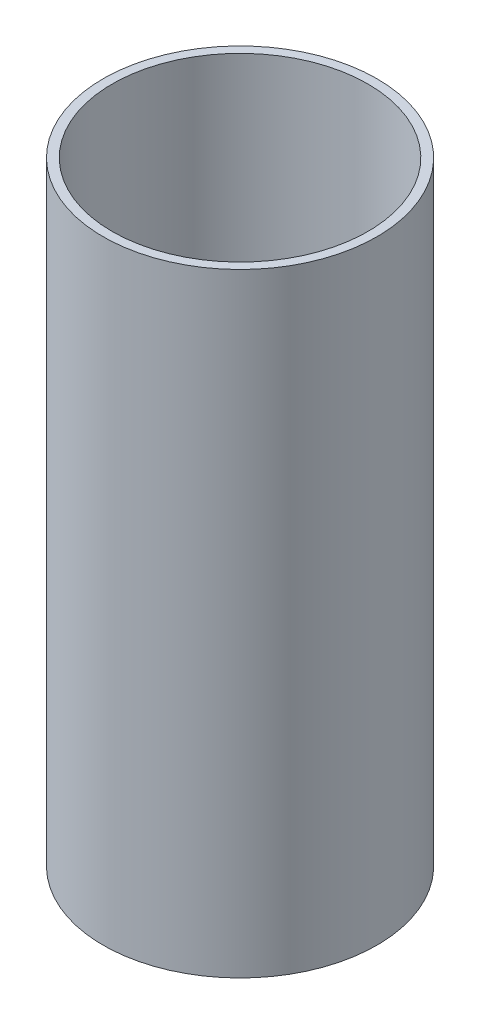
ISO-10303-21;
HEADER;
FILE_DESCRIPTION(('STEP AP214'),'2;1');
FILE_NAME('part.step','',(''),(''),'','','');
FILE_SCHEMA(('AUTOMOTIVE_DESIGN { 1 0 10303 214 1 1 1 1 }'));
ENDSEC;
DATA;
#1=APPLICATION_CONTEXT('core data for automotive mechanical design processes');
#2=APPLICATION_PROTOCOL_DEFINITION('international standard','automotive_design',2000,#1);
#3=PRODUCT_CONTEXT('',#1,'mechanical');
#4=PRODUCT('Part','Part','',(#3));
#5=PRODUCT_RELATED_PRODUCT_CATEGORY('part','',(#4));
#6=PRODUCT_DEFINITION_FORMATION('','',#4);
#7=PRODUCT_DEFINITION_CONTEXT('part definition',#1,'design');
#8=PRODUCT_DEFINITION('design','',#6,#7);
#9=PRODUCT_DEFINITION_SHAPE('','',#8);
#10=(LENGTH_UNIT() NAMED_UNIT(*) SI_UNIT(.MILLI.,.METRE.));
#11=(NAMED_UNIT(*) PLANE_ANGLE_UNIT() SI_UNIT($,.RADIAN.));
#12=(NAMED_UNIT(*) SI_UNIT($,.STERADIAN.) SOLID_ANGLE_UNIT());
#13=UNCERTAINTY_MEASURE_WITH_UNIT(LENGTH_MEASURE(1.E-05),#10,'distance_accuracy_value','');
#14=(GEOMETRIC_REPRESENTATION_CONTEXT(3) GLOBAL_UNCERTAINTY_ASSIGNED_CONTEXT((#13)) GLOBAL_UNIT_ASSIGNED_CONTEXT((#10,
#11,#12)) REPRESENTATION_CONTEXT('',''));
#15=CARTESIAN_POINT('',(0.,0.,0.));
#16=DIRECTION('',(0.,0.,1.));
#17=DIRECTION('',(1.,0.,0.));
#18=AXIS2_PLACEMENT_3D('',#15,#16,#17);
#19=CARTESIAN_POINT('',(0.,-8.89,0.));
#20=DIRECTION('',(0.,-1.,0.));
#21=DIRECTION('',(0.,0.,-1.));
#22=AXIS2_PLACEMENT_3D('',#19,#20,#21);
#23=CYLINDRICAL_SURFACE('',#22,25.4508);
#24=CARTESIAN_POINT('',(0.,0.,0.));
#25=DIRECTION('',(0.,-1.,0.));
#26=DIRECTION('',(0.,0.,-1.));
#27=AXIS2_PLACEMENT_3D('',#24,#25,#26);
#28=CIRCLE('',#27,25.4508);
#29=CARTESIAN_POINT('',(0.,0.,-25.4508));
#30=VERTEX_POINT('',#29);
#31=EDGE_CURVE('E50',#30,#30,#28,.T.);
#32=ORIENTED_EDGE('',*,*,#31,.T.);
#33=EDGE_LOOP('',(#32));
#34=FACE_BOUND('',#33,.T.);
#35=CARTESIAN_POINT('',(0.,122.1486,0.));
#36=DIRECTION('',(0.,-1.,0.));
#37=DIRECTION('',(0.,0.,-1.));
#38=AXIS2_PLACEMENT_3D('',#35,#36,#37);
#39=CIRCLE('',#38,25.4508);
#40=CARTESIAN_POINT('',(0.,122.1486,-25.4508));
#41=VERTEX_POINT('',#40);
#42=EDGE_CURVE('E10',#41,#41,#39,.T.);
#43=ORIENTED_EDGE('',*,*,#42,.F.);
#44=EDGE_LOOP('',(#43));
#45=FACE_BOUND('',#44,.T.);
#46=ADVANCED_FACE('F36',(#34,#45),#23,.F.);
#47=CARTESIAN_POINT('',(25.4508,122.1486,0.));
#48=DIRECTION('',(0.,1.,0.));
#49=DIRECTION('',(0.,0.,1.));
#50=AXIS2_PLACEMENT_3D('',#47,#48,#49);
#51=PLANE('',#50);
#52=ORIENTED_EDGE('',*,*,#42,.T.);
#53=EDGE_LOOP('',(#52));
#54=FACE_BOUND('',#53,.T.);
#55=CARTESIAN_POINT('',(0.,122.1486,0.));
#56=DIRECTION('',(0.,-1.,0.));
#57=DIRECTION('',(0.,0.,-1.));
#58=AXIS2_PLACEMENT_3D('',#55,#56,#57);
#59=CIRCLE('',#58,27.2542);
#60=CARTESIAN_POINT('',(0.,122.1486,-27.2542));
#61=VERTEX_POINT('',#60);
#62=EDGE_CURVE('E42',#61,#61,#59,.T.);
#63=ORIENTED_EDGE('',*,*,#62,.F.);
#64=EDGE_LOOP('',(#63));
#65=FACE_BOUND('',#64,.T.);
#66=ADVANCED_FACE('F66',(#54,#65),#51,.T.);
#67=CARTESIAN_POINT('',(0.,-8.89,0.));
#68=DIRECTION('',(0.,-1.,0.));
#69=DIRECTION('',(0.,0.,-1.));
#70=AXIS2_PLACEMENT_3D('',#67,#68,#69);
#71=CYLINDRICAL_SURFACE('',#70,27.2542);
#72=ORIENTED_EDGE('',*,*,#62,.T.);
#73=EDGE_LOOP('',(#72));
#74=FACE_BOUND('',#73,.T.);
#75=CARTESIAN_POINT('',(0.,0.,0.));
#76=DIRECTION('',(0.,-1.,0.));
#77=DIRECTION('',(0.,0.,-1.));
#78=AXIS2_PLACEMENT_3D('',#75,#76,#77);
#79=CIRCLE('',#78,27.2542);
#80=CARTESIAN_POINT('',(0.,0.,-27.2542));
#81=VERTEX_POINT('',#80);
#82=EDGE_CURVE('E46',#81,#81,#79,.T.);
#83=ORIENTED_EDGE('',*,*,#82,.F.);
#84=EDGE_LOOP('',(#83));
#85=FACE_BOUND('',#84,.T.);
#86=ADVANCED_FACE('F60',(#74,#85),#71,.T.);
#87=CARTESIAN_POINT('',(25.4508,0.,0.));
#88=DIRECTION('',(0.,-1.,0.));
#89=DIRECTION('',(0.,0.,-1.));
#90=AXIS2_PLACEMENT_3D('',#87,#88,#89);
#91=PLANE('',#90);
#92=ORIENTED_EDGE('',*,*,#82,.T.);
#93=EDGE_LOOP('',(#92));
#94=FACE_BOUND('',#93,.T.);
#95=ORIENTED_EDGE('',*,*,#31,.F.);
#96=EDGE_LOOP('',(#95));
#97=FACE_BOUND('',#96,.T.);
#98=ADVANCED_FACE('F58',(#94,#97),#91,.T.);
#99=CLOSED_SHELL('',(#46,#66,#86,#98));
#100=MANIFOLD_SOLID_BREP('B2',#99);
#101=ADVANCED_BREP_SHAPE_REPRESENTATION('',(#18,#100),#14);
#102=SHAPE_DEFINITION_REPRESENTATION(#9,#101);
ENDSEC;
END-ISO-10303-21;
